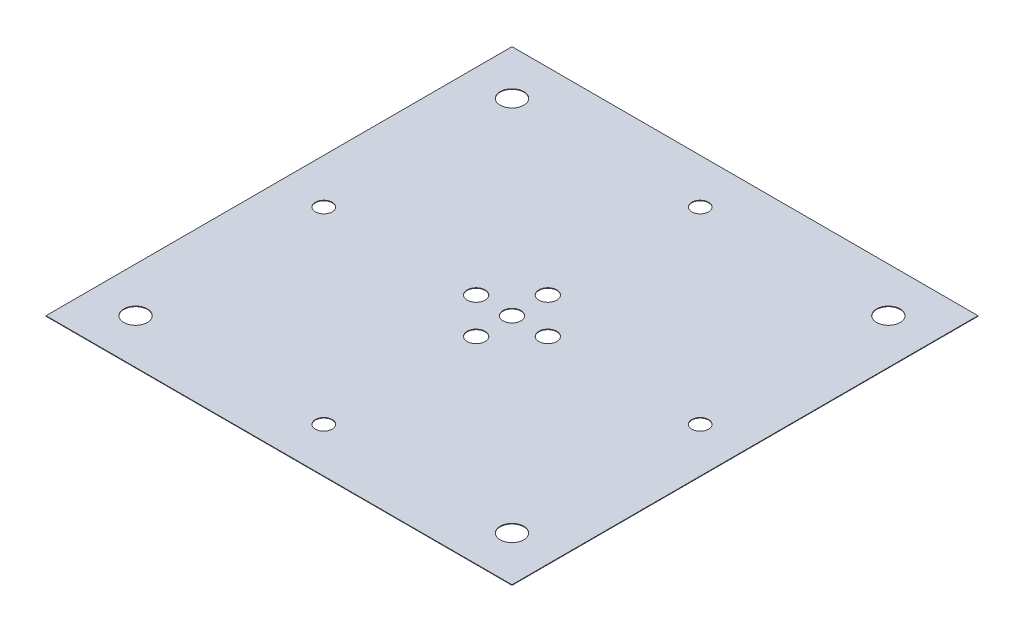
ISO-10303-21;
HEADER;
FILE_DESCRIPTION(('STEP AP214'),'2;1');
FILE_NAME('part.step','',(''),(''),'','','');
FILE_SCHEMA(('AUTOMOTIVE_DESIGN { 1 0 10303 214 1 1 1 1 }'));
ENDSEC;
DATA;
#1=APPLICATION_CONTEXT('core data for automotive mechanical design processes');
#2=APPLICATION_PROTOCOL_DEFINITION('international standard','automotive_design',2000,#1);
#3=PRODUCT_CONTEXT('',#1,'mechanical');
#4=PRODUCT('Part','Part','',(#3));
#5=PRODUCT_RELATED_PRODUCT_CATEGORY('part','',(#4));
#6=PRODUCT_DEFINITION_FORMATION('','',#4);
#7=PRODUCT_DEFINITION_CONTEXT('part definition',#1,'design');
#8=PRODUCT_DEFINITION('design','',#6,#7);
#9=PRODUCT_DEFINITION_SHAPE('','',#8);
#10=(LENGTH_UNIT() NAMED_UNIT(*) SI_UNIT(.MILLI.,.METRE.));
#11=(NAMED_UNIT(*) PLANE_ANGLE_UNIT() SI_UNIT($,.RADIAN.));
#12=(NAMED_UNIT(*) SI_UNIT($,.STERADIAN.) SOLID_ANGLE_UNIT());
#13=UNCERTAINTY_MEASURE_WITH_UNIT(LENGTH_MEASURE(1.E-05),#10,'distance_accuracy_value','');
#14=(GEOMETRIC_REPRESENTATION_CONTEXT(3) GLOBAL_UNCERTAINTY_ASSIGNED_CONTEXT((#13)) GLOBAL_UNIT_ASSIGNED_CONTEXT((#10,
#11,#12)) REPRESENTATION_CONTEXT('',''));
#15=CARTESIAN_POINT('',(0.,0.,0.));
#16=DIRECTION('',(0.,0.,1.));
#17=DIRECTION('',(1.,0.,0.));
#18=AXIS2_PLACEMENT_3D('',#15,#16,#17);
#19=CARTESIAN_POINT('',(-1297.,3.,1297.));
#20=DIRECTION('',(0.,1.,0.));
#21=DIRECTION('',(0.,0.,1.));
#22=AXIS2_PLACEMENT_3D('',#19,#20,#21);
#23=PLANE('',#22);
#24=DIRECTION('',(0.,0.,1.));
#25=VECTOR('',#24,1.);
#26=CARTESIAN_POINT('',(-1300.,3.00000000000011,-1300.));
#27=LINE('',#26,#25);
#28=CARTESIAN_POINT('',(-1300.,3.00000000000011,-1300.));
#29=VERTEX_POINT('',#28);
#30=CARTESIAN_POINT('',(-1300.,3.00000000000011,1300.));
#31=VERTEX_POINT('',#30);
#32=EDGE_CURVE('E83',#29,#31,#27,.T.);
#33=ORIENTED_EDGE('',*,*,#32,.T.);
#34=DIRECTION('',(1.,0.,0.));
#35=VECTOR('',#34,1.);
#36=CARTESIAN_POINT('',(-1300.,3.00000000000011,1300.));
#37=LINE('',#36,#35);
#38=CARTESIAN_POINT('',(1300.,3.00000000000011,1300.));
#39=VERTEX_POINT('',#38);
#40=EDGE_CURVE('E90',#31,#39,#37,.T.);
#41=ORIENTED_EDGE('',*,*,#40,.T.);
#42=DIRECTION('',(0.,0.,-1.));
#43=VECTOR('',#42,1.);
#44=CARTESIAN_POINT('',(1300.,3.00000000000011,-1300.));
#45=LINE('',#44,#43);
#46=CARTESIAN_POINT('',(1300.,3.00000000000011,-1300.));
#47=VERTEX_POINT('',#46);
#48=EDGE_CURVE('E95',#39,#47,#45,.T.);
#49=ORIENTED_EDGE('',*,*,#48,.T.);
#50=DIRECTION('',(-1.,0.,0.));
#51=VECTOR('',#50,1.);
#52=CARTESIAN_POINT('',(-1300.,3.00000000000011,-1300.));
#53=LINE('',#52,#51);
#54=EDGE_CURVE('E99',#47,#29,#53,.T.);
#55=ORIENTED_EDGE('',*,*,#54,.T.);
#56=EDGE_LOOP('',(#33,#41,#49,#55));
#57=FACE_BOUND('',#56,.T.);
#58=CARTESIAN_POINT('',(-1050.,3.,1050.));
#59=DIRECTION('',(0.,1.,0.));
#60=DIRECTION('',(0.,0.,1.));
#61=AXIS2_PLACEMENT_3D('',#58,#59,#60);
#62=CIRCLE('',#61,65.8000000000001);
#63=CARTESIAN_POINT('',(-1050.,3.,1115.8));
#64=VERTEX_POINT('',#63);
#65=EDGE_CURVE('E177',#64,#64,#62,.T.);
#66=ORIENTED_EDGE('',*,*,#65,.F.);
#67=EDGE_LOOP('',(#66));
#68=FACE_BOUND('',#67,.T.);
#69=CARTESIAN_POINT('',(-1050.,3.,4.44089209850063E-12));
#70=DIRECTION('',(0.,1.,0.));
#71=DIRECTION('',(0.,0.,1.));
#72=AXIS2_PLACEMENT_3D('',#69,#70,#71);
#73=CIRCLE('',#72,46.7500000000002);
#74=CARTESIAN_POINT('',(-1050.,3.,46.7500000000047));
#75=VERTEX_POINT('',#74);
#76=EDGE_CURVE('E174',#75,#75,#73,.T.);
#77=ORIENTED_EDGE('',*,*,#76,.F.);
#78=EDGE_LOOP('',(#77));
#79=FACE_BOUND('',#78,.T.);
#80=CARTESIAN_POINT('',(-200.,3.,8.04911692853238E-13));
#81=DIRECTION('',(0.,1.,0.));
#82=DIRECTION('',(0.,0.,1.));
#83=AXIS2_PLACEMENT_3D('',#80,#81,#82);
#84=CIRCLE('',#83,49.85);
#85=CARTESIAN_POINT('',(-200.,3.,49.8500000000008));
#86=VERTEX_POINT('',#85);
#87=EDGE_CURVE('E171',#86,#86,#84,.T.);
#88=ORIENTED_EDGE('',*,*,#87,.F.);
#89=EDGE_LOOP('',(#88));
#90=FACE_BOUND('',#89,.T.);
#91=CARTESIAN_POINT('',(-1050.,3.,-1050.));
#92=DIRECTION('',(0.,1.,0.));
#93=DIRECTION('',(0.,0.,1.));
#94=AXIS2_PLACEMENT_3D('',#91,#92,#93);
#95=CIRCLE('',#94,65.8000000000002);
#96=CARTESIAN_POINT('',(-1050.,3.,-984.199999999999));
#97=VERTEX_POINT('',#96);
#98=EDGE_CURVE('E168',#97,#97,#95,.T.);
#99=ORIENTED_EDGE('',*,*,#98,.F.);
#100=EDGE_LOOP('',(#99));
#101=FACE_BOUND('',#100,.T.);
#102=CARTESIAN_POINT('',(1050.,3.,-1050.));
#103=DIRECTION('',(0.,1.,0.));
#104=DIRECTION('',(0.,0.,1.));
#105=AXIS2_PLACEMENT_3D('',#102,#103,#104);
#106=CIRCLE('',#105,65.8000000000001);
#107=CARTESIAN_POINT('',(1050.,3.,-984.2));
#108=VERTEX_POINT('',#107);
#109=EDGE_CURVE('E165',#108,#108,#106,.T.);
#110=ORIENTED_EDGE('',*,*,#109,.F.);
#111=EDGE_LOOP('',(#110));
#112=FACE_BOUND('',#111,.T.);
#113=CARTESIAN_POINT('',(-4.42870752857281E-12,3.,-1050.));
#114=DIRECTION('',(0.,1.,0.));
#115=DIRECTION('',(0.,0.,1.));
#116=AXIS2_PLACEMENT_3D('',#113,#114,#115);
#117=CIRCLE('',#116,46.75);
#118=CARTESIAN_POINT('',(-4.42870752857281E-12,3.,-1003.25));
#119=VERTEX_POINT('',#118);
#120=EDGE_CURVE('E162',#119,#119,#117,.T.);
#121=ORIENTED_EDGE('',*,*,#120,.F.);
#122=EDGE_LOOP('',(#121));
#123=FACE_BOUND('',#122,.T.);
#124=CARTESIAN_POINT('',(-9.08094404702185E-13,3.,-200.));
#125=DIRECTION('',(0.,1.,0.));
#126=DIRECTION('',(0.,0.,1.));
#127=AXIS2_PLACEMENT_3D('',#124,#125,#126);
#128=CIRCLE('',#127,49.85);
#129=CARTESIAN_POINT('',(-9.08094404702185E-13,3.,-150.15));
#130=VERTEX_POINT('',#129);
#131=EDGE_CURVE('E159',#130,#130,#128,.T.);
#132=ORIENTED_EDGE('',*,*,#131,.F.);
#133=EDGE_LOOP('',(#132));
#134=FACE_BOUND('',#133,.T.);
#135=CARTESIAN_POINT('',(200.,3.,8.04911692853238E-13));
#136=DIRECTION('',(0.,1.,0.));
#137=DIRECTION('',(0.,0.,1.));
#138=AXIS2_PLACEMENT_3D('',#135,#136,#137);
#139=CIRCLE('',#138,49.85);
#140=CARTESIAN_POINT('',(200.,3.,49.8500000000008));
#141=VERTEX_POINT('',#140);
#142=EDGE_CURVE('E156',#141,#141,#139,.T.);
#143=ORIENTED_EDGE('',*,*,#142,.F.);
#144=EDGE_LOOP('',(#143));
#145=FACE_BOUND('',#144,.T.);
#146=CARTESIAN_POINT('',(1050.,3.,3.99680288865056E-12));
#147=DIRECTION('',(0.,1.,0.));
#148=DIRECTION('',(0.,0.,1.));
#149=AXIS2_PLACEMENT_3D('',#146,#147,#148);
#150=CIRCLE('',#149,46.7500000000001);
#151=CARTESIAN_POINT('',(1050.,3.,46.7500000000041));
#152=VERTEX_POINT('',#151);
#153=EDGE_CURVE('E153',#152,#152,#150,.T.);
#154=ORIENTED_EDGE('',*,*,#153,.F.);
#155=EDGE_LOOP('',(#154));
#156=FACE_BOUND('',#155,.T.);
#157=CARTESIAN_POINT('',(1050.,3.,1050.));
#158=DIRECTION('',(0.,1.,0.));
#159=DIRECTION('',(0.,0.,1.));
#160=AXIS2_PLACEMENT_3D('',#157,#158,#159);
#161=CIRCLE('',#160,65.8000000000001);
#162=CARTESIAN_POINT('',(1050.,3.,1115.8));
#163=VERTEX_POINT('',#162);
#164=EDGE_CURVE('E150',#163,#163,#161,.T.);
#165=ORIENTED_EDGE('',*,*,#164,.F.);
#166=EDGE_LOOP('',(#165));
#167=FACE_BOUND('',#166,.T.);
#168=CARTESIAN_POINT('',(-9.08094404702185E-13,3.,200.));
#169=DIRECTION('',(0.,1.,0.));
#170=DIRECTION('',(0.,0.,1.));
#171=AXIS2_PLACEMENT_3D('',#168,#169,#170);
#172=CIRCLE('',#171,49.85);
#173=CARTESIAN_POINT('',(-9.08094404702185E-13,3.,249.85));
#174=VERTEX_POINT('',#173);
#175=EDGE_CURVE('E147',#174,#174,#172,.T.);
#176=ORIENTED_EDGE('',*,*,#175,.F.);
#177=EDGE_LOOP('',(#176));
#178=FACE_BOUND('',#177,.T.);
#179=CARTESIAN_POINT('',(-4.42870752857281E-12,3.,1050.));
#180=DIRECTION('',(0.,1.,0.));
#181=DIRECTION('',(0.,0.,1.));
#182=AXIS2_PLACEMENT_3D('',#179,#180,#181);
#183=CIRCLE('',#182,46.7499999999999);
#184=CARTESIAN_POINT('',(-4.42870752857281E-12,3.,1096.75));
#185=VERTEX_POINT('',#184);
#186=EDGE_CURVE('E144',#185,#185,#183,.T.);
#187=ORIENTED_EDGE('',*,*,#186,.F.);
#188=EDGE_LOOP('',(#187));
#189=FACE_BOUND('',#188,.T.);
#190=CARTESIAN_POINT('',(-2.22044604925031E-13,3.,2.22044604925031E-13));
#191=DIRECTION('',(0.,1.,0.));
#192=DIRECTION('',(0.,0.,1.));
#193=AXIS2_PLACEMENT_3D('',#190,#191,#192);
#194=CIRCLE('',#193,49.85);
#195=CARTESIAN_POINT('',(-2.22044604925031E-13,3.,49.8500000000002));
#196=VERTEX_POINT('',#195);
#197=EDGE_CURVE('E141',#196,#196,#194,.T.);
#198=ORIENTED_EDGE('',*,*,#197,.F.);
#199=EDGE_LOOP('',(#198));
#200=FACE_BOUND('',#199,.T.);
#201=ADVANCED_FACE('F38',(#57,#68,#79,#90,#101,#112,#123,#134,#145,#156,#167,#178,#189,#200),
#23,.T.);
#202=CARTESIAN_POINT('',(1300.,2597.,-1300.));
#203=DIRECTION('',(-1.,0.,0.));
#204=DIRECTION('',(0.,0.,1.));
#205=AXIS2_PLACEMENT_3D('',#202,#203,#204);
#206=PLANE('',#205);
#207=ORIENTED_EDGE('',*,*,#48,.F.);
#208=DIRECTION('',(0.,-1.,0.));
#209=VECTOR('',#208,1.);
#210=CARTESIAN_POINT('',(1300.,2597.,1300.));
#211=LINE('',#210,#209);
#212=CARTESIAN_POINT('',(1300.,0.,1300.));
#213=VERTEX_POINT('',#212);
#214=EDGE_CURVE('E42',#39,#213,#211,.T.);
#215=ORIENTED_EDGE('',*,*,#214,.T.);
#216=DIRECTION('',(0.,0.,-1.));
#217=VECTOR('',#216,1.);
#218=CARTESIAN_POINT('',(1300.,0.,-1300.));
#219=LINE('',#218,#217);
#220=CARTESIAN_POINT('',(1300.,0.,-1300.));
#221=VERTEX_POINT('',#220);
#222=EDGE_CURVE('E180',#213,#221,#219,.T.);
#223=ORIENTED_EDGE('',*,*,#222,.T.);
#224=DIRECTION('',(0.,-1.,0.));
#225=VECTOR('',#224,1.);
#226=CARTESIAN_POINT('',(1300.,2597.,-1300.));
#227=LINE('',#226,#225);
#228=EDGE_CURVE('E55',#47,#221,#227,.T.);
#229=ORIENTED_EDGE('',*,*,#228,.F.);
#230=EDGE_LOOP('',(#207,#215,#223,#229));
#231=FACE_BOUND('',#230,.T.);
#232=ADVANCED_FACE('F188',(#231),#206,.F.);
#233=CARTESIAN_POINT('',(-1300.,2597.,1300.));
#234=DIRECTION('',(0.,0.,-1.));
#235=DIRECTION('',(-1.,0.,0.));
#236=AXIS2_PLACEMENT_3D('',#233,#234,#235);
#237=PLANE('',#236);
#238=ORIENTED_EDGE('',*,*,#40,.F.);
#239=DIRECTION('',(0.,-1.,0.));
#240=VECTOR('',#239,1.);
#241=CARTESIAN_POINT('',(-1300.,2597.,1300.));
#242=LINE('',#241,#240);
#243=CARTESIAN_POINT('',(-1300.,0.,1300.));
#244=VERTEX_POINT('',#243);
#245=EDGE_CURVE('E79',#31,#244,#242,.T.);
#246=ORIENTED_EDGE('',*,*,#245,.T.);
#247=DIRECTION('',(1.,0.,0.));
#248=VECTOR('',#247,1.);
#249=CARTESIAN_POINT('',(-1300.,0.,1300.));
#250=LINE('',#249,#248);
#251=EDGE_CURVE('E185',#244,#213,#250,.T.);
#252=ORIENTED_EDGE('',*,*,#251,.T.);
#253=ORIENTED_EDGE('',*,*,#214,.F.);
#254=EDGE_LOOP('',(#238,#246,#252,#253));
#255=FACE_BOUND('',#254,.T.);
#256=ADVANCED_FACE('F91',(#255),#237,.F.);
#257=CARTESIAN_POINT('',(0.,0.,0.));
#258=DIRECTION('',(0.,1.,0.));
#259=DIRECTION('',(0.,0.,1.));
#260=AXIS2_PLACEMENT_3D('',#257,#258,#259);
#261=PLANE('',#260);
#262=CARTESIAN_POINT('',(-1050.,0.,1050.));
#263=DIRECTION('',(0.,1.,0.));
#264=DIRECTION('',(0.,0.,1.));
#265=AXIS2_PLACEMENT_3D('',#262,#263,#264);
#266=CIRCLE('',#265,65.8000000000001);
#267=CARTESIAN_POINT('',(-1050.,0.,1115.8));
#268=VERTEX_POINT('',#267);
#269=EDGE_CURVE('E119',#268,#268,#266,.T.);
#270=ORIENTED_EDGE('',*,*,#269,.T.);
#271=EDGE_LOOP('',(#270));
#272=FACE_BOUND('',#271,.T.);
#273=CARTESIAN_POINT('',(-1050.,0.,4.44089209850063E-12));
#274=DIRECTION('',(0.,1.,0.));
#275=DIRECTION('',(0.,0.,1.));
#276=AXIS2_PLACEMENT_3D('',#273,#274,#275);
#277=CIRCLE('',#276,46.7500000000002);
#278=CARTESIAN_POINT('',(-1050.,0.,46.7500000000047));
#279=VERTEX_POINT('',#278);
#280=EDGE_CURVE('E133',#279,#279,#277,.T.);
#281=ORIENTED_EDGE('',*,*,#280,.T.);
#282=EDGE_LOOP('',(#281));
#283=FACE_BOUND('',#282,.T.);
#284=CARTESIAN_POINT('',(-200.,0.,8.04911692853238E-13));
#285=DIRECTION('',(0.,1.,0.));
#286=DIRECTION('',(0.,0.,1.));
#287=AXIS2_PLACEMENT_3D('',#284,#285,#286);
#288=CIRCLE('',#287,49.85);
#289=CARTESIAN_POINT('',(-200.,0.,49.8500000000008));
#290=VERTEX_POINT('',#289);
#291=EDGE_CURVE('E47',#290,#290,#288,.T.);
#292=ORIENTED_EDGE('',*,*,#291,.T.);
#293=EDGE_LOOP('',(#292));
#294=FACE_BOUND('',#293,.T.);
#295=CARTESIAN_POINT('',(-1050.,0.,-1050.));
#296=DIRECTION('',(0.,1.,0.));
#297=DIRECTION('',(0.,0.,-1.));
#298=AXIS2_PLACEMENT_3D('',#295,#296,#297);
#299=CIRCLE('',#298,65.8000000000002);
#300=CARTESIAN_POINT('',(-1050.,0.,-1115.8));
#301=VERTEX_POINT('',#300);
#302=EDGE_CURVE('E11',#301,#301,#299,.T.);
#303=ORIENTED_EDGE('',*,*,#302,.T.);
#304=EDGE_LOOP('',(#303));
#305=FACE_BOUND('',#304,.T.);
#306=CARTESIAN_POINT('',(1050.,0.,-1050.));
#307=DIRECTION('',(0.,1.,0.));
#308=DIRECTION('',(0.,0.,1.));
#309=AXIS2_PLACEMENT_3D('',#306,#307,#308);
#310=CIRCLE('',#309,65.8000000000001);
#311=CARTESIAN_POINT('',(1050.,0.,-984.2));
#312=VERTEX_POINT('',#311);
#313=EDGE_CURVE('E120',#312,#312,#310,.T.);
#314=ORIENTED_EDGE('',*,*,#313,.T.);
#315=EDGE_LOOP('',(#314));
#316=FACE_BOUND('',#315,.T.);
#317=CARTESIAN_POINT('',(-4.42870752857281E-12,0.,-1050.));
#318=DIRECTION('',(0.,1.,0.));
#319=DIRECTION('',(0.,0.,1.));
#320=AXIS2_PLACEMENT_3D('',#317,#318,#319);
#321=CIRCLE('',#320,46.75);
#322=CARTESIAN_POINT('',(-4.42870752857281E-12,0.,-1003.25));
#323=VERTEX_POINT('',#322);
#324=EDGE_CURVE('E123',#323,#323,#321,.T.);
#325=ORIENTED_EDGE('',*,*,#324,.T.);
#326=EDGE_LOOP('',(#325));
#327=FACE_BOUND('',#326,.T.);
#328=CARTESIAN_POINT('',(-9.08094404702185E-13,0.,-200.));
#329=DIRECTION('',(0.,1.,0.));
#330=DIRECTION('',(0.,0.,1.));
#331=AXIS2_PLACEMENT_3D('',#328,#329,#330);
#332=CIRCLE('',#331,49.85);
#333=CARTESIAN_POINT('',(-9.08094404702185E-13,0.,-150.15));
#334=VERTEX_POINT('',#333);
#335=EDGE_CURVE('E127',#334,#334,#332,.T.);
#336=ORIENTED_EDGE('',*,*,#335,.T.);
#337=EDGE_LOOP('',(#336));
#338=FACE_BOUND('',#337,.T.);
#339=CARTESIAN_POINT('',(200.,0.,8.04911692853238E-13));
#340=DIRECTION('',(0.,1.,0.));
#341=DIRECTION('',(0.,0.,-1.));
#342=AXIS2_PLACEMENT_3D('',#339,#340,#341);
#343=CIRCLE('',#342,49.85);
#344=CARTESIAN_POINT('',(200.,0.,-49.8499999999992));
#345=VERTEX_POINT('',#344);
#346=EDGE_CURVE('E110',#345,#345,#343,.T.);
#347=ORIENTED_EDGE('',*,*,#346,.T.);
#348=EDGE_LOOP('',(#347));
#349=FACE_BOUND('',#348,.T.);
#350=CARTESIAN_POINT('',(1050.,0.,3.99680288865056E-12));
#351=DIRECTION('',(0.,1.,0.));
#352=DIRECTION('',(0.,0.,-1.));
#353=AXIS2_PLACEMENT_3D('',#350,#351,#352);
#354=CIRCLE('',#353,46.7500000000001);
#355=CARTESIAN_POINT('',(1050.,0.,-46.7499999999961));
#356=VERTEX_POINT('',#355);
#357=EDGE_CURVE('E106',#356,#356,#354,.T.);
#358=ORIENTED_EDGE('',*,*,#357,.T.);
#359=EDGE_LOOP('',(#358));
#360=FACE_BOUND('',#359,.T.);
#361=CARTESIAN_POINT('',(1050.,0.,1050.));
#362=DIRECTION('',(0.,1.,0.));
#363=DIRECTION('',(0.,0.,-1.));
#364=AXIS2_PLACEMENT_3D('',#361,#362,#363);
#365=CIRCLE('',#364,65.8000000000001);
#366=CARTESIAN_POINT('',(1050.,0.,984.2));
#367=VERTEX_POINT('',#366);
#368=EDGE_CURVE('E109',#367,#367,#365,.T.);
#369=ORIENTED_EDGE('',*,*,#368,.T.);
#370=EDGE_LOOP('',(#369));
#371=FACE_BOUND('',#370,.T.);
#372=CARTESIAN_POINT('',(-9.08094404702185E-13,0.,200.));
#373=DIRECTION('',(0.,1.,0.));
#374=DIRECTION('',(0.,0.,-1.));
#375=AXIS2_PLACEMENT_3D('',#372,#373,#374);
#376=CIRCLE('',#375,49.85);
#377=CARTESIAN_POINT('',(-9.08094404702185E-13,0.,150.15));
#378=VERTEX_POINT('',#377);
#379=EDGE_CURVE('E113',#378,#378,#376,.T.);
#380=ORIENTED_EDGE('',*,*,#379,.T.);
#381=EDGE_LOOP('',(#380));
#382=FACE_BOUND('',#381,.T.);
#383=CARTESIAN_POINT('',(-4.42870752857281E-12,0.,1050.));
#384=DIRECTION('',(0.,1.,0.));
#385=DIRECTION('',(0.,0.,-1.));
#386=AXIS2_PLACEMENT_3D('',#383,#384,#385);
#387=CIRCLE('',#386,46.7499999999999);
#388=CARTESIAN_POINT('',(-4.42870752857281E-12,0.,1003.25));
#389=VERTEX_POINT('',#388);
#390=EDGE_CURVE('E116',#389,#389,#387,.T.);
#391=ORIENTED_EDGE('',*,*,#390,.T.);
#392=EDGE_LOOP('',(#391));
#393=FACE_BOUND('',#392,.T.);
#394=CARTESIAN_POINT('',(-2.22044604925031E-13,0.,2.22044604925031E-13));
#395=DIRECTION('',(0.,1.,0.));
#396=DIRECTION('',(0.,0.,1.));
#397=AXIS2_PLACEMENT_3D('',#394,#395,#396);
#398=CIRCLE('',#397,49.85);
#399=CARTESIAN_POINT('',(-2.22044604925031E-13,0.,49.8500000000002));
#400=VERTEX_POINT('',#399);
#401=EDGE_CURVE('E124',#400,#400,#398,.T.);
#402=ORIENTED_EDGE('',*,*,#401,.T.);
#403=EDGE_LOOP('',(#402));
#404=FACE_BOUND('',#403,.T.);
#405=ORIENTED_EDGE('',*,*,#251,.F.);
#406=DIRECTION('',(0.,0.,1.));
#407=VECTOR('',#406,1.);
#408=CARTESIAN_POINT('',(-1300.,0.,-1300.));
#409=LINE('',#408,#407);
#410=CARTESIAN_POINT('',(-1300.,0.,-1300.));
#411=VERTEX_POINT('',#410);
#412=EDGE_CURVE('E85',#411,#244,#409,.T.);
#413=ORIENTED_EDGE('',*,*,#412,.F.);
#414=DIRECTION('',(-1.,0.,0.));
#415=VECTOR('',#414,1.);
#416=CARTESIAN_POINT('',(-1300.,0.,-1300.));
#417=LINE('',#416,#415);
#418=EDGE_CURVE('E182',#221,#411,#417,.T.);
#419=ORIENTED_EDGE('',*,*,#418,.F.);
#420=ORIENTED_EDGE('',*,*,#222,.F.);
#421=EDGE_LOOP('',(#405,#413,#419,#420));
#422=FACE_BOUND('',#421,.T.);
#423=ADVANCED_FACE('F192',(#272,#283,#294,#305,#316,#327,#338,#349,#360,#371,#382,#393,#404,
#422),#261,.F.);
#424=CARTESIAN_POINT('',(-1050.,0.,1050.));
#425=DIRECTION('',(0.,1.,0.));
#426=DIRECTION('',(0.,0.,1.));
#427=AXIS2_PLACEMENT_3D('',#424,#425,#426);
#428=CYLINDRICAL_SURFACE('',#427,65.8000000000001);
#429=ORIENTED_EDGE('',*,*,#65,.T.);
#430=EDGE_LOOP('',(#429));
#431=FACE_BOUND('',#430,.T.);
#432=ORIENTED_EDGE('',*,*,#269,.F.);
#433=EDGE_LOOP('',(#432));
#434=FACE_BOUND('',#433,.T.);
#435=ADVANCED_FACE('F40',(#431,#434),#428,.F.);
#436=CARTESIAN_POINT('',(-1050.,0.,4.44089209850063E-12));
#437=DIRECTION('',(0.,1.,0.));
#438=DIRECTION('',(0.,0.,1.));
#439=AXIS2_PLACEMENT_3D('',#436,#437,#438);
#440=CYLINDRICAL_SURFACE('',#439,46.7500000000002);
#441=ORIENTED_EDGE('',*,*,#76,.T.);
#442=EDGE_LOOP('',(#441));
#443=FACE_BOUND('',#442,.T.);
#444=ORIENTED_EDGE('',*,*,#280,.F.);
#445=EDGE_LOOP('',(#444));
#446=FACE_BOUND('',#445,.T.);
#447=ADVANCED_FACE('F200',(#443,#446),#440,.F.);
#448=CARTESIAN_POINT('',(-200.,0.,8.04911692853238E-13));
#449=DIRECTION('',(0.,1.,0.));
#450=DIRECTION('',(0.,0.,1.));
#451=AXIS2_PLACEMENT_3D('',#448,#449,#450);
#452=CYLINDRICAL_SURFACE('',#451,49.85);
#453=ORIENTED_EDGE('',*,*,#87,.T.);
#454=EDGE_LOOP('',(#453));
#455=FACE_BOUND('',#454,.T.);
#456=ORIENTED_EDGE('',*,*,#291,.F.);
#457=EDGE_LOOP('',(#456));
#458=FACE_BOUND('',#457,.T.);
#459=ADVANCED_FACE('F254',(#455,#458),#452,.F.);
#460=CARTESIAN_POINT('',(-1050.,0.,-1050.));
#461=DIRECTION('',(0.,1.,0.));
#462=DIRECTION('',(0.,0.,1.));
#463=AXIS2_PLACEMENT_3D('',#460,#461,#462);
#464=CYLINDRICAL_SURFACE('',#463,65.8000000000002);
#465=ORIENTED_EDGE('',*,*,#98,.T.);
#466=EDGE_LOOP('',(#465));
#467=FACE_BOUND('',#466,.T.);
#468=ORIENTED_EDGE('',*,*,#302,.F.);
#469=EDGE_LOOP('',(#468));
#470=FACE_BOUND('',#469,.T.);
#471=ADVANCED_FACE('F250',(#467,#470),#464,.F.);
#472=CARTESIAN_POINT('',(1050.,0.,-1050.));
#473=DIRECTION('',(0.,1.,0.));
#474=DIRECTION('',(0.,0.,1.));
#475=AXIS2_PLACEMENT_3D('',#472,#473,#474);
#476=CYLINDRICAL_SURFACE('',#475,65.8000000000001);
#477=ORIENTED_EDGE('',*,*,#109,.T.);
#478=EDGE_LOOP('',(#477));
#479=FACE_BOUND('',#478,.T.);
#480=ORIENTED_EDGE('',*,*,#313,.F.);
#481=EDGE_LOOP('',(#480));
#482=FACE_BOUND('',#481,.T.);
#483=ADVANCED_FACE('F246',(#479,#482),#476,.F.);
#484=CARTESIAN_POINT('',(-4.42870752857281E-12,0.,-1050.));
#485=DIRECTION('',(0.,1.,0.));
#486=DIRECTION('',(0.,0.,1.));
#487=AXIS2_PLACEMENT_3D('',#484,#485,#486);
#488=CYLINDRICAL_SURFACE('',#487,46.75);
#489=ORIENTED_EDGE('',*,*,#120,.T.);
#490=EDGE_LOOP('',(#489));
#491=FACE_BOUND('',#490,.T.);
#492=ORIENTED_EDGE('',*,*,#324,.F.);
#493=EDGE_LOOP('',(#492));
#494=FACE_BOUND('',#493,.T.);
#495=ADVANCED_FACE('F242',(#491,#494),#488,.F.);
#496=CARTESIAN_POINT('',(-9.08094404702185E-13,0.,-200.));
#497=DIRECTION('',(0.,1.,0.));
#498=DIRECTION('',(0.,0.,1.));
#499=AXIS2_PLACEMENT_3D('',#496,#497,#498);
#500=CYLINDRICAL_SURFACE('',#499,49.85);
#501=ORIENTED_EDGE('',*,*,#131,.T.);
#502=EDGE_LOOP('',(#501));
#503=FACE_BOUND('',#502,.T.);
#504=ORIENTED_EDGE('',*,*,#335,.F.);
#505=EDGE_LOOP('',(#504));
#506=FACE_BOUND('',#505,.T.);
#507=ADVANCED_FACE('F238',(#503,#506),#500,.F.);
#508=CARTESIAN_POINT('',(200.,0.,8.04911692853238E-13));
#509=DIRECTION('',(0.,1.,0.));
#510=DIRECTION('',(0.,0.,1.));
#511=AXIS2_PLACEMENT_3D('',#508,#509,#510);
#512=CYLINDRICAL_SURFACE('',#511,49.85);
#513=ORIENTED_EDGE('',*,*,#142,.T.);
#514=EDGE_LOOP('',(#513));
#515=FACE_BOUND('',#514,.T.);
#516=ORIENTED_EDGE('',*,*,#346,.F.);
#517=EDGE_LOOP('',(#516));
#518=FACE_BOUND('',#517,.T.);
#519=ADVANCED_FACE('F234',(#515,#518),#512,.F.);
#520=CARTESIAN_POINT('',(1050.,0.,3.99680288865056E-12));
#521=DIRECTION('',(0.,1.,0.));
#522=DIRECTION('',(0.,0.,1.));
#523=AXIS2_PLACEMENT_3D('',#520,#521,#522);
#524=CYLINDRICAL_SURFACE('',#523,46.7500000000001);
#525=ORIENTED_EDGE('',*,*,#153,.T.);
#526=EDGE_LOOP('',(#525));
#527=FACE_BOUND('',#526,.T.);
#528=ORIENTED_EDGE('',*,*,#357,.F.);
#529=EDGE_LOOP('',(#528));
#530=FACE_BOUND('',#529,.T.);
#531=ADVANCED_FACE('F230',(#527,#530),#524,.F.);
#532=CARTESIAN_POINT('',(1050.,0.,1050.));
#533=DIRECTION('',(0.,1.,0.));
#534=DIRECTION('',(0.,0.,1.));
#535=AXIS2_PLACEMENT_3D('',#532,#533,#534);
#536=CYLINDRICAL_SURFACE('',#535,65.8000000000001);
#537=ORIENTED_EDGE('',*,*,#164,.T.);
#538=EDGE_LOOP('',(#537));
#539=FACE_BOUND('',#538,.T.);
#540=ORIENTED_EDGE('',*,*,#368,.F.);
#541=EDGE_LOOP('',(#540));
#542=FACE_BOUND('',#541,.T.);
#543=ADVANCED_FACE('F226',(#539,#542),#536,.F.);
#544=CARTESIAN_POINT('',(-9.08094404702185E-13,0.,200.));
#545=DIRECTION('',(0.,1.,0.));
#546=DIRECTION('',(0.,0.,1.));
#547=AXIS2_PLACEMENT_3D('',#544,#545,#546);
#548=CYLINDRICAL_SURFACE('',#547,49.85);
#549=ORIENTED_EDGE('',*,*,#175,.T.);
#550=EDGE_LOOP('',(#549));
#551=FACE_BOUND('',#550,.T.);
#552=ORIENTED_EDGE('',*,*,#379,.F.);
#553=EDGE_LOOP('',(#552));
#554=FACE_BOUND('',#553,.T.);
#555=ADVANCED_FACE('F222',(#551,#554),#548,.F.);
#556=CARTESIAN_POINT('',(-4.42870752857281E-12,0.,1050.));
#557=DIRECTION('',(0.,1.,0.));
#558=DIRECTION('',(0.,0.,1.));
#559=AXIS2_PLACEMENT_3D('',#556,#557,#558);
#560=CYLINDRICAL_SURFACE('',#559,46.7499999999999);
#561=ORIENTED_EDGE('',*,*,#186,.T.);
#562=EDGE_LOOP('',(#561));
#563=FACE_BOUND('',#562,.T.);
#564=ORIENTED_EDGE('',*,*,#390,.F.);
#565=EDGE_LOOP('',(#564));
#566=FACE_BOUND('',#565,.T.);
#567=ADVANCED_FACE('F218',(#563,#566),#560,.F.);
#568=CARTESIAN_POINT('',(-2.22044604925031E-13,0.,2.22044604925031E-13));
#569=DIRECTION('',(0.,1.,0.));
#570=DIRECTION('',(0.,0.,1.));
#571=AXIS2_PLACEMENT_3D('',#568,#569,#570);
#572=CYLINDRICAL_SURFACE('',#571,49.85);
#573=ORIENTED_EDGE('',*,*,#197,.T.);
#574=EDGE_LOOP('',(#573));
#575=FACE_BOUND('',#574,.T.);
#576=ORIENTED_EDGE('',*,*,#401,.F.);
#577=EDGE_LOOP('',(#576));
#578=FACE_BOUND('',#577,.T.);
#579=ADVANCED_FACE('F213',(#575,#578),#572,.F.);
#580=CARTESIAN_POINT('',(-1300.,2597.,-1300.));
#581=DIRECTION('',(0.,0.,1.));
#582=DIRECTION('',(1.,0.,0.));
#583=AXIS2_PLACEMENT_3D('',#580,#581,#582);
#584=PLANE('',#583);
#585=ORIENTED_EDGE('',*,*,#54,.F.);
#586=ORIENTED_EDGE('',*,*,#228,.T.);
#587=ORIENTED_EDGE('',*,*,#418,.T.);
#588=DIRECTION('',(0.,-1.,0.));
#589=VECTOR('',#588,1.);
#590=CARTESIAN_POINT('',(-1300.,2597.,-1300.));
#591=LINE('',#590,#589);
#592=EDGE_CURVE('E63',#29,#411,#591,.T.);
#593=ORIENTED_EDGE('',*,*,#592,.F.);
#594=EDGE_LOOP('',(#585,#586,#587,#593));
#595=FACE_BOUND('',#594,.T.);
#596=ADVANCED_FACE('F190',(#595),#584,.F.);
#597=CARTESIAN_POINT('',(-1300.,2597.,-1300.));
#598=DIRECTION('',(1.,0.,0.));
#599=DIRECTION('',(0.,0.,-1.));
#600=AXIS2_PLACEMENT_3D('',#597,#598,#599);
#601=PLANE('',#600);
#602=ORIENTED_EDGE('',*,*,#32,.F.);
#603=ORIENTED_EDGE('',*,*,#592,.T.);
#604=ORIENTED_EDGE('',*,*,#412,.T.);
#605=ORIENTED_EDGE('',*,*,#245,.F.);
#606=EDGE_LOOP('',(#602,#603,#604,#605));
#607=FACE_BOUND('',#606,.T.);
#608=ADVANCED_FACE('F81',(#607),#601,.F.);
#609=CLOSED_SHELL('',(#201,#232,#256,#423,#435,#447,#459,#471,#483,#495,#507,#519,#531,#543,
#555,#567,#579,#596,#608));
#610=MANIFOLD_SOLID_BREP('B2',#609);
#611=ADVANCED_BREP_SHAPE_REPRESENTATION('',(#18,#610),#14);
#612=SHAPE_DEFINITION_REPRESENTATION(#9,#611);
ENDSEC;
END-ISO-10303-21;
